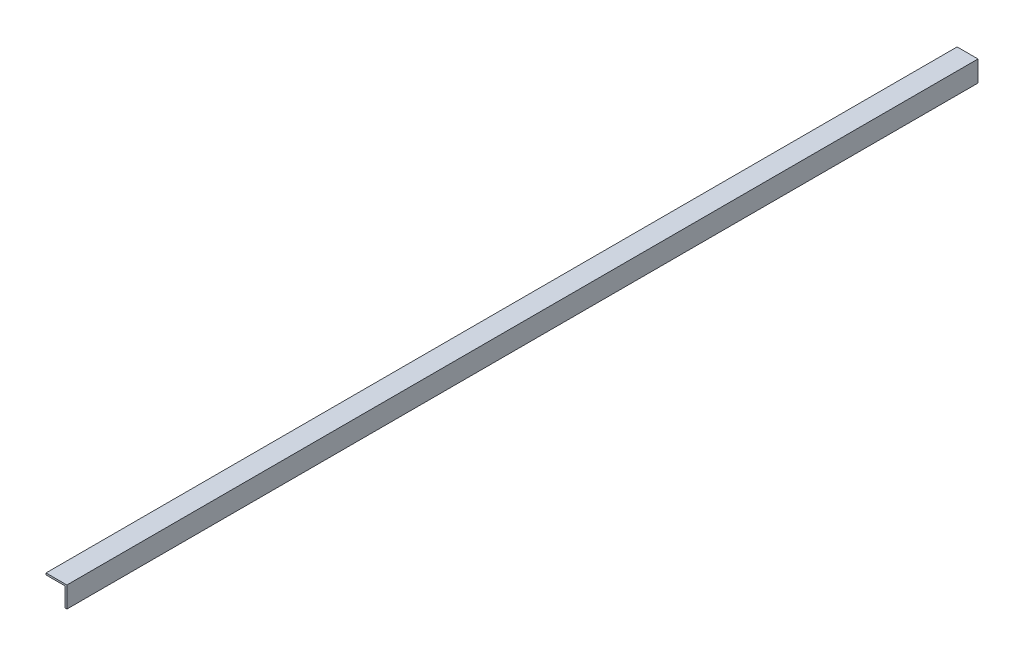
ISO-10303-21;
HEADER;
FILE_DESCRIPTION(('STEP AP214'),'2;1');
FILE_NAME('part.step','',(''),(''),'','','');
FILE_SCHEMA(('AUTOMOTIVE_DESIGN { 1 0 10303 214 1 1 1 1 }'));
ENDSEC;
DATA;
#1=APPLICATION_CONTEXT('core data for automotive mechanical design processes');
#2=APPLICATION_PROTOCOL_DEFINITION('international standard','automotive_design',2000,#1);
#3=PRODUCT_CONTEXT('',#1,'mechanical');
#4=PRODUCT('Part','Part','',(#3));
#5=PRODUCT_RELATED_PRODUCT_CATEGORY('part','',(#4));
#6=PRODUCT_DEFINITION_FORMATION('','',#4);
#7=PRODUCT_DEFINITION_CONTEXT('part definition',#1,'design');
#8=PRODUCT_DEFINITION('design','',#6,#7);
#9=PRODUCT_DEFINITION_SHAPE('','',#8);
#10=(LENGTH_UNIT() NAMED_UNIT(*) SI_UNIT(.MILLI.,.METRE.));
#11=(NAMED_UNIT(*) PLANE_ANGLE_UNIT() SI_UNIT($,.RADIAN.));
#12=(NAMED_UNIT(*) SI_UNIT($,.STERADIAN.) SOLID_ANGLE_UNIT());
#13=UNCERTAINTY_MEASURE_WITH_UNIT(LENGTH_MEASURE(1.E-05),#10,'distance_accuracy_value','');
#14=(GEOMETRIC_REPRESENTATION_CONTEXT(3) GLOBAL_UNCERTAINTY_ASSIGNED_CONTEXT((#13)) GLOBAL_UNIT_ASSIGNED_CONTEXT((#10,
#11,#12)) REPRESENTATION_CONTEXT('',''));
#15=CARTESIAN_POINT('',(0.,0.,0.));
#16=DIRECTION('',(0.,0.,1.));
#17=DIRECTION('',(1.,0.,0.));
#18=AXIS2_PLACEMENT_3D('',#15,#16,#17);
#19=CARTESIAN_POINT('',(-31.6691860950269,23.4521323342555,0.));
#20=DIRECTION('',(-1.,0.,0.));
#21=DIRECTION('',(0.,0.,1.));
#22=AXIS2_PLACEMENT_3D('',#19,#20,#21);
#23=PLANE('',#22);
#24=DIRECTION('',(0.,1.,0.));
#25=VECTOR('',#24,1.);
#26=CARTESIAN_POINT('',(-31.6691860950269,15.5807781675889,1662.1125));
#27=LINE('',#26,#25);
#28=CARTESIAN_POINT('',(-31.6691860950269,26.6271323342554,1662.1125));
#29=VERTEX_POINT('',#28);
#30=CARTESIAN_POINT('',(-31.6691860950269,23.4521323342555,1662.1125));
#31=VERTEX_POINT('',#30);
#32=EDGE_CURVE('E103',#29,#31,#27,.F.);
#33=ORIENTED_EDGE('',*,*,#32,.F.);
#34=DIRECTION('',(0.,0.,1.));
#35=VECTOR('',#34,1.);
#36=CARTESIAN_POINT('',(-31.6691860950269,26.6271323342554,0.));
#37=LINE('',#36,#35);
#38=CARTESIAN_POINT('',(-31.6691860950269,26.6271323342554,0.));
#39=VERTEX_POINT('',#38);
#40=EDGE_CURVE('E75',#39,#29,#37,.T.);
#41=ORIENTED_EDGE('',*,*,#40,.F.);
#42=DIRECTION('',(0.,1.,0.));
#43=VECTOR('',#42,1.);
#44=CARTESIAN_POINT('',(-31.6691860950269,15.5807781675889,0.));
#45=LINE('',#44,#43);
#46=CARTESIAN_POINT('',(-31.6691860950269,23.4521323342555,0.));
#47=VERTEX_POINT('',#46);
#48=EDGE_CURVE('E72',#39,#47,#45,.F.);
#49=ORIENTED_EDGE('',*,*,#48,.T.);
#50=DIRECTION('',(0.,0.,-1.));
#51=VECTOR('',#50,1.);
#52=CARTESIAN_POINT('',(-31.6691860950269,23.4521323342555,0.));
#53=LINE('',#52,#51);
#54=EDGE_CURVE('E20',#31,#47,#53,.T.);
#55=ORIENTED_EDGE('',*,*,#54,.F.);
#56=EDGE_LOOP('',(#33,#41,#49,#55));
#57=FACE_BOUND('',#56,.T.);
#58=ADVANCED_FACE('F17',(#57),#23,.T.);
#59=CARTESIAN_POINT('',(3.25581390497296,23.4521323342555,0.));
#60=DIRECTION('',(0.,-1.,0.));
#61=DIRECTION('',(0.,0.,-1.));
#62=AXIS2_PLACEMENT_3D('',#59,#60,#61);
#63=PLANE('',#62);
#64=DIRECTION('',(1.,0.,0.));
#65=VECTOR('',#64,1.);
#66=CARTESIAN_POINT('',(-4.6155402616937,23.4521323342555,1662.1125));
#67=LINE('',#66,#65);
#68=CARTESIAN_POINT('',(3.25581390497296,23.4521323342555,1662.1125));
#69=VERTEX_POINT('',#68);
#70=EDGE_CURVE('E82',#31,#69,#67,.T.);
#71=ORIENTED_EDGE('',*,*,#70,.F.);
#72=ORIENTED_EDGE('',*,*,#54,.T.);
#73=DIRECTION('',(1.,0.,0.));
#74=VECTOR('',#73,1.);
#75=CARTESIAN_POINT('',(-4.6155402616937,23.4521323342555,0.));
#76=LINE('',#75,#74);
#77=CARTESIAN_POINT('',(3.25581390497296,23.4521323342555,0.));
#78=VERTEX_POINT('',#77);
#79=EDGE_CURVE('E67',#47,#78,#76,.T.);
#80=ORIENTED_EDGE('',*,*,#79,.T.);
#81=DIRECTION('',(0.,0.,1.));
#82=VECTOR('',#81,1.);
#83=CARTESIAN_POINT('',(3.25581390497296,23.4521323342555,0.));
#84=LINE('',#83,#82);
#85=EDGE_CURVE('E78',#69,#78,#84,.F.);
#86=ORIENTED_EDGE('',*,*,#85,.F.);
#87=EDGE_LOOP('',(#71,#72,#80,#86));
#88=FACE_BOUND('',#87,.T.);
#89=ADVANCED_FACE('F80',(#88),#63,.T.);
#90=CARTESIAN_POINT('',(3.25581390497296,-11.4728676657445,0.));
#91=DIRECTION('',(-1.,0.,0.));
#92=DIRECTION('',(0.,0.,1.));
#93=AXIS2_PLACEMENT_3D('',#90,#91,#92);
#94=PLANE('',#93);
#95=DIRECTION('',(0.,1.,0.));
#96=VECTOR('',#95,1.);
#97=CARTESIAN_POINT('',(3.25581390497296,15.5807781675889,1662.1125));
#98=LINE('',#97,#96);
#99=CARTESIAN_POINT('',(3.25581390497296,-11.4728676657445,1662.1125));
#100=VERTEX_POINT('',#99);
#101=EDGE_CURVE('E96',#69,#100,#98,.F.);
#102=ORIENTED_EDGE('',*,*,#101,.F.);
#103=ORIENTED_EDGE('',*,*,#85,.T.);
#104=DIRECTION('',(0.,1.,0.));
#105=VECTOR('',#104,1.);
#106=CARTESIAN_POINT('',(3.25581390497296,15.5807781675889,0.));
#107=LINE('',#106,#105);
#108=CARTESIAN_POINT('',(3.25581390497296,-11.4728676657445,0.));
#109=VERTEX_POINT('',#108);
#110=EDGE_CURVE('E87',#78,#109,#107,.F.);
#111=ORIENTED_EDGE('',*,*,#110,.T.);
#112=DIRECTION('',(0.,0.,-1.));
#113=VECTOR('',#112,1.);
#114=CARTESIAN_POINT('',(3.25581390497296,-11.4728676657445,0.));
#115=LINE('',#114,#113);
#116=EDGE_CURVE('E98',#100,#109,#115,.T.);
#117=ORIENTED_EDGE('',*,*,#116,.F.);
#118=EDGE_LOOP('',(#102,#103,#111,#117));
#119=FACE_BOUND('',#118,.T.);
#120=ADVANCED_FACE('F94',(#119),#94,.T.);
#121=CARTESIAN_POINT('',(-4.6155402616937,15.5807781675889,0.));
#122=DIRECTION('',(0.,0.,1.));
#123=DIRECTION('',(1.,0.,0.));
#124=AXIS2_PLACEMENT_3D('',#121,#122,#123);
#125=PLANE('',#124);
#126=DIRECTION('',(1.,0.,0.));
#127=VECTOR('',#126,1.);
#128=CARTESIAN_POINT('',(6.43081390497296,-11.4728676657445,0.));
#129=LINE('',#128,#127);
#130=CARTESIAN_POINT('',(6.43081390497296,-11.4728676657445,0.));
#131=VERTEX_POINT('',#130);
#132=EDGE_CURVE('E104',#109,#131,#129,.T.);
#133=ORIENTED_EDGE('',*,*,#132,.F.);
#134=ORIENTED_EDGE('',*,*,#110,.F.);
#135=ORIENTED_EDGE('',*,*,#79,.F.);
#136=ORIENTED_EDGE('',*,*,#48,.F.);
#137=DIRECTION('',(1.,0.,0.));
#138=VECTOR('',#137,1.);
#139=CARTESIAN_POINT('',(-31.6691860950269,26.6271323342554,0.));
#140=LINE('',#139,#138);
#141=CARTESIAN_POINT('',(6.43081390497296,26.6271323342554,0.));
#142=VERTEX_POINT('',#141);
#143=EDGE_CURVE('E89',#142,#39,#140,.F.);
#144=ORIENTED_EDGE('',*,*,#143,.F.);
#145=DIRECTION('',(0.,1.,0.));
#146=VECTOR('',#145,1.);
#147=CARTESIAN_POINT('',(6.43081390497296,26.6271323342554,0.));
#148=LINE('',#147,#146);
#149=EDGE_CURVE('E118',#131,#142,#148,.T.);
#150=ORIENTED_EDGE('',*,*,#149,.F.);
#151=EDGE_LOOP('',(#133,#134,#135,#136,#144,#150));
#152=FACE_BOUND('',#151,.T.);
#153=ADVANCED_FACE('F86',(#152),#125,.F.);
#154=CARTESIAN_POINT('',(-31.6691860950269,26.6271323342554,0.));
#155=DIRECTION('',(0.,1.,0.));
#156=DIRECTION('',(0.,0.,1.));
#157=AXIS2_PLACEMENT_3D('',#154,#155,#156);
#158=PLANE('',#157);
#159=DIRECTION('',(1.,0.,0.));
#160=VECTOR('',#159,1.);
#161=CARTESIAN_POINT('',(-4.6155402616937,26.6271323342554,1662.1125));
#162=LINE('',#161,#160);
#163=CARTESIAN_POINT('',(6.43081390497296,26.6271323342554,1662.1125));
#164=VERTEX_POINT('',#163);
#165=EDGE_CURVE('E99',#164,#29,#162,.F.);
#166=ORIENTED_EDGE('',*,*,#165,.F.);
#167=DIRECTION('',(0.,0.,-1.));
#168=VECTOR('',#167,1.);
#169=CARTESIAN_POINT('',(6.43081390497296,26.6271323342554,0.));
#170=LINE('',#169,#168);
#171=EDGE_CURVE('E116',#142,#164,#170,.F.);
#172=ORIENTED_EDGE('',*,*,#171,.F.);
#173=ORIENTED_EDGE('',*,*,#143,.T.);
#174=ORIENTED_EDGE('',*,*,#40,.T.);
#175=EDGE_LOOP('',(#166,#172,#173,#174));
#176=FACE_BOUND('',#175,.T.);
#177=ADVANCED_FACE('F114',(#176),#158,.T.);
#178=CARTESIAN_POINT('',(-4.6155402616937,15.5807781675889,1662.1125));
#179=DIRECTION('',(0.,0.,1.));
#180=DIRECTION('',(1.,0.,0.));
#181=AXIS2_PLACEMENT_3D('',#178,#179,#180);
#182=PLANE('',#181);
#183=ORIENTED_EDGE('',*,*,#32,.T.);
#184=ORIENTED_EDGE('',*,*,#70,.T.);
#185=ORIENTED_EDGE('',*,*,#101,.T.);
#186=DIRECTION('',(1.,0.,0.));
#187=VECTOR('',#186,1.);
#188=CARTESIAN_POINT('',(6.43081390497296,-11.4728676657445,1662.1125));
#189=LINE('',#188,#187);
#190=CARTESIAN_POINT('',(6.43081390497296,-11.4728676657445,1662.1125));
#191=VERTEX_POINT('',#190);
#192=EDGE_CURVE('E35',#191,#100,#189,.F.);
#193=ORIENTED_EDGE('',*,*,#192,.F.);
#194=DIRECTION('',(0.,1.,0.));
#195=VECTOR('',#194,1.);
#196=CARTESIAN_POINT('',(6.43081390497296,26.6271323342554,1662.1125));
#197=LINE('',#196,#195);
#198=EDGE_CURVE('E26',#164,#191,#197,.F.);
#199=ORIENTED_EDGE('',*,*,#198,.F.);
#200=ORIENTED_EDGE('',*,*,#165,.T.);
#201=EDGE_LOOP('',(#183,#184,#185,#193,#199,#200));
#202=FACE_BOUND('',#201,.T.);
#203=ADVANCED_FACE('F101',(#202),#182,.T.);
#204=CARTESIAN_POINT('',(6.43081390497296,-11.4728676657445,0.));
#205=DIRECTION('',(0.,-1.,0.));
#206=DIRECTION('',(0.,0.,-1.));
#207=AXIS2_PLACEMENT_3D('',#204,#205,#206);
#208=PLANE('',#207);
#209=ORIENTED_EDGE('',*,*,#192,.T.);
#210=ORIENTED_EDGE('',*,*,#116,.T.);
#211=ORIENTED_EDGE('',*,*,#132,.T.);
#212=DIRECTION('',(0.,0.,-1.));
#213=VECTOR('',#212,1.);
#214=CARTESIAN_POINT('',(6.43081390497296,-11.4728676657445,0.));
#215=LINE('',#214,#213);
#216=EDGE_CURVE('E11',#191,#131,#215,.T.);
#217=ORIENTED_EDGE('',*,*,#216,.F.);
#218=EDGE_LOOP('',(#209,#210,#211,#217));
#219=FACE_BOUND('',#218,.T.);
#220=ADVANCED_FACE('F122',(#219),#208,.T.);
#221=CARTESIAN_POINT('',(6.43081390497296,26.6271323342554,0.));
#222=DIRECTION('',(1.,0.,0.));
#223=DIRECTION('',(0.,0.,-1.));
#224=AXIS2_PLACEMENT_3D('',#221,#222,#223);
#225=PLANE('',#224);
#226=ORIENTED_EDGE('',*,*,#198,.T.);
#227=ORIENTED_EDGE('',*,*,#216,.T.);
#228=ORIENTED_EDGE('',*,*,#149,.T.);
#229=ORIENTED_EDGE('',*,*,#171,.T.);
#230=EDGE_LOOP('',(#226,#227,#228,#229));
#231=FACE_BOUND('',#230,.T.);
#232=ADVANCED_FACE('F124',(#231),#225,.T.);
#233=CLOSED_SHELL('',(#58,#89,#120,#153,#177,#203,#220,#232));
#234=MANIFOLD_SOLID_BREP('B1',#233);
#235=ADVANCED_BREP_SHAPE_REPRESENTATION('',(#18,#234),#14);
#236=SHAPE_DEFINITION_REPRESENTATION(#9,#235);
ENDSEC;
END-ISO-10303-21;
